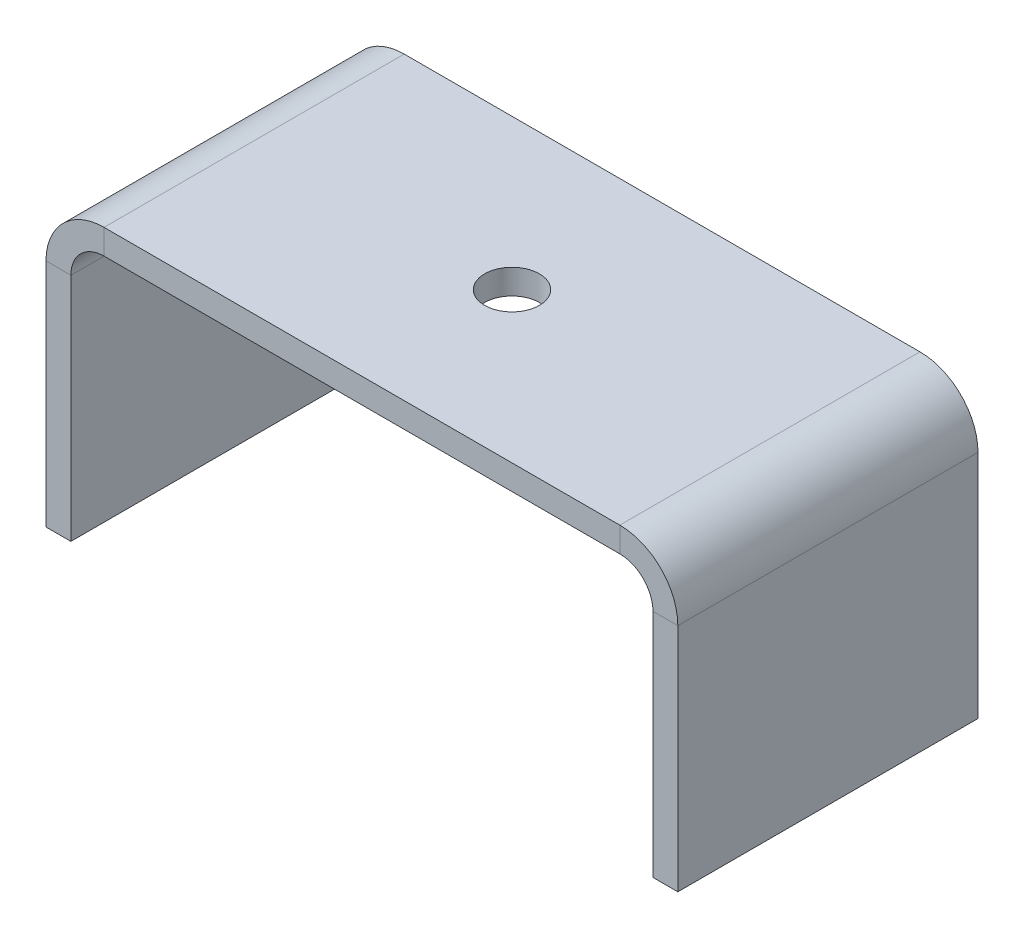
ISO-10303-21;
HEADER;
FILE_DESCRIPTION(('STEP AP214'),'2;1');
FILE_NAME('part.step','',(''),(''),'','','');
FILE_SCHEMA(('AUTOMOTIVE_DESIGN { 1 0 10303 214 1 1 1 1 }'));
ENDSEC;
DATA;
#1=APPLICATION_CONTEXT('core data for automotive mechanical design processes');
#2=APPLICATION_PROTOCOL_DEFINITION('international standard','automotive_design',2000,#1);
#3=PRODUCT_CONTEXT('',#1,'mechanical');
#4=PRODUCT('Part','Part','',(#3));
#5=PRODUCT_RELATED_PRODUCT_CATEGORY('part','',(#4));
#6=PRODUCT_DEFINITION_FORMATION('','',#4);
#7=PRODUCT_DEFINITION_CONTEXT('part definition',#1,'design');
#8=PRODUCT_DEFINITION('design','',#6,#7);
#9=PRODUCT_DEFINITION_SHAPE('','',#8);
#10=(LENGTH_UNIT() NAMED_UNIT(*) SI_UNIT(.MILLI.,.METRE.));
#11=(NAMED_UNIT(*) PLANE_ANGLE_UNIT() SI_UNIT($,.RADIAN.));
#12=(NAMED_UNIT(*) SI_UNIT($,.STERADIAN.) SOLID_ANGLE_UNIT());
#13=UNCERTAINTY_MEASURE_WITH_UNIT(LENGTH_MEASURE(1.E-05),#10,'distance_accuracy_value','');
#14=(GEOMETRIC_REPRESENTATION_CONTEXT(3) GLOBAL_UNCERTAINTY_ASSIGNED_CONTEXT((#13)) GLOBAL_UNIT_ASSIGNED_CONTEXT((#10,
#11,#12)) REPRESENTATION_CONTEXT('',''));
#15=CARTESIAN_POINT('',(0.,0.,0.));
#16=DIRECTION('',(0.,0.,1.));
#17=DIRECTION('',(1.,0.,0.));
#18=AXIS2_PLACEMENT_3D('',#15,#16,#17);
#19=CARTESIAN_POINT('',(38.1,10.4,18.1));
#20=DIRECTION('',(0.,0.,1.));
#21=DIRECTION('',(1.,0.,0.));
#22=AXIS2_PLACEMENT_3D('',#19,#20,#21);
#23=PLANE('',#22);
#24=DIRECTION('',(-1.,0.,0.));
#25=VECTOR('',#24,1.);
#26=CARTESIAN_POINT('',(38.1,10.4,18.1));
#27=LINE('',#26,#25);
#28=CARTESIAN_POINT('',(38.1,10.4,18.1));
#29=VERTEX_POINT('',#28);
#30=CARTESIAN_POINT('',(35.1,10.4,18.1));
#31=VERTEX_POINT('',#30);
#32=EDGE_CURVE('E11',#29,#31,#27,.T.);
#33=ORIENTED_EDGE('',*,*,#32,.F.);
#34=CARTESIAN_POINT('',(31.1,10.4,18.1));
#35=DIRECTION('',(0.,0.,-1.));
#36=DIRECTION('',(-1.,0.,0.));
#37=AXIS2_PLACEMENT_3D('',#34,#35,#36);
#38=CIRCLE('',#37,7.);
#39=CARTESIAN_POINT('',(31.0999999999999,17.4,18.1));
#40=VERTEX_POINT('',#39);
#41=EDGE_CURVE('E149',#29,#40,#38,.F.);
#42=ORIENTED_EDGE('',*,*,#41,.T.);
#43=DIRECTION('',(0.,1.,0.));
#44=VECTOR('',#43,1.);
#45=CARTESIAN_POINT('',(31.0999999999999,14.4,18.1));
#46=LINE('',#45,#44);
#47=CARTESIAN_POINT('',(31.0999999999999,14.4,18.1));
#48=VERTEX_POINT('',#47);
#49=EDGE_CURVE('E47',#48,#40,#46,.T.);
#50=ORIENTED_EDGE('',*,*,#49,.F.);
#51=CARTESIAN_POINT('',(31.1,10.4,18.1));
#52=DIRECTION('',(0.,0.,1.));
#53=DIRECTION('',(1.,0.,0.));
#54=AXIS2_PLACEMENT_3D('',#51,#52,#53);
#55=CIRCLE('',#54,4.);
#56=EDGE_CURVE('E244',#31,#48,#55,.T.);
#57=ORIENTED_EDGE('',*,*,#56,.F.);
#58=EDGE_LOOP('',(#33,#42,#50,#57));
#59=FACE_BOUND('',#58,.T.);
#60=ADVANCED_FACE('F39',(#59),#23,.T.);
#61=CARTESIAN_POINT('',(31.0999999999999,14.4,18.1));
#62=DIRECTION('',(0.,0.,1.));
#63=DIRECTION('',(1.,0.,0.));
#64=AXIS2_PLACEMENT_3D('',#61,#62,#63);
#65=PLANE('',#64);
#66=DIRECTION('',(0.,1.,0.));
#67=VECTOR('',#66,1.);
#68=CARTESIAN_POINT('',(38.1,17.4,18.1));
#69=LINE('',#68,#67);
#70=CARTESIAN_POINT('',(38.1,-17.4,18.1));
#71=VERTEX_POINT('',#70);
#72=EDGE_CURVE('E154',#71,#29,#69,.T.);
#73=ORIENTED_EDGE('',*,*,#72,.T.);
#74=ORIENTED_EDGE('',*,*,#32,.T.);
#75=DIRECTION('',(0.,1.,0.));
#76=VECTOR('',#75,1.);
#77=CARTESIAN_POINT('',(35.1,17.4,18.1));
#78=LINE('',#77,#76);
#79=CARTESIAN_POINT('',(35.1,-17.4,18.1));
#80=VERTEX_POINT('',#79);
#81=EDGE_CURVE('E257',#80,#31,#78,.T.);
#82=ORIENTED_EDGE('',*,*,#81,.F.);
#83=DIRECTION('',(-1.,0.,0.));
#84=VECTOR('',#83,1.);
#85=CARTESIAN_POINT('',(38.1,-17.4,18.1));
#86=LINE('',#85,#84);
#87=EDGE_CURVE('E259',#71,#80,#86,.T.);
#88=ORIENTED_EDGE('',*,*,#87,.F.);
#89=EDGE_LOOP('',(#73,#74,#82,#88));
#90=FACE_BOUND('',#89,.T.);
#91=ADVANCED_FACE('F270',(#90),#65,.T.);
#92=CARTESIAN_POINT('',(31.0999999999999,17.4,-18.1));
#93=DIRECTION('',(0.,0.,-1.));
#94=DIRECTION('',(-1.,0.,0.));
#95=AXIS2_PLACEMENT_3D('',#92,#93,#94);
#96=PLANE('',#95);
#97=DIRECTION('',(0.,-1.,0.));
#98=VECTOR('',#97,1.);
#99=CARTESIAN_POINT('',(31.0999999999999,17.4,-18.1));
#100=LINE('',#99,#98);
#101=CARTESIAN_POINT('',(31.0999999999999,17.4,-18.1));
#102=VERTEX_POINT('',#101);
#103=CARTESIAN_POINT('',(31.0999999999999,14.4,-18.1));
#104=VERTEX_POINT('',#103);
#105=EDGE_CURVE('E147',#102,#104,#100,.T.);
#106=ORIENTED_EDGE('',*,*,#105,.F.);
#107=CARTESIAN_POINT('',(31.1,10.4,-18.1));
#108=DIRECTION('',(0.,0.,-1.));
#109=DIRECTION('',(-1.,0.,0.));
#110=AXIS2_PLACEMENT_3D('',#107,#108,#109);
#111=CIRCLE('',#110,7.);
#112=CARTESIAN_POINT('',(38.1,10.4,-18.1));
#113=VERTEX_POINT('',#112);
#114=EDGE_CURVE('E161',#113,#102,#111,.F.);
#115=ORIENTED_EDGE('',*,*,#114,.F.);
#116=DIRECTION('',(1.,0.,0.));
#117=VECTOR('',#116,1.);
#118=CARTESIAN_POINT('',(35.1,10.4,-18.1));
#119=LINE('',#118,#117);
#120=CARTESIAN_POINT('',(35.1,10.4,-18.1));
#121=VERTEX_POINT('',#120);
#122=EDGE_CURVE('E235',#121,#113,#119,.T.);
#123=ORIENTED_EDGE('',*,*,#122,.F.);
#124=CARTESIAN_POINT('',(31.1,10.4,-18.1));
#125=DIRECTION('',(0.,0.,1.));
#126=DIRECTION('',(1.,0.,0.));
#127=AXIS2_PLACEMENT_3D('',#124,#125,#126);
#128=CIRCLE('',#127,4.);
#129=EDGE_CURVE('E189',#121,#104,#128,.T.);
#130=ORIENTED_EDGE('',*,*,#129,.T.);
#131=EDGE_LOOP('',(#106,#115,#123,#130));
#132=FACE_BOUND('',#131,.T.);
#133=ADVANCED_FACE('F249',(#132),#96,.T.);
#134=CARTESIAN_POINT('',(35.1,10.4,-18.1));
#135=DIRECTION('',(0.,0.,-1.));
#136=DIRECTION('',(-1.,0.,0.));
#137=AXIS2_PLACEMENT_3D('',#134,#135,#136);
#138=PLANE('',#137);
#139=DIRECTION('',(-1.,0.,0.));
#140=VECTOR('',#139,1.);
#141=CARTESIAN_POINT('',(-38.1,17.4,-18.1));
#142=LINE('',#141,#140);
#143=CARTESIAN_POINT('',(-31.1,17.4,-18.1));
#144=VERTEX_POINT('',#143);
#145=EDGE_CURVE('E202',#102,#144,#142,.T.);
#146=ORIENTED_EDGE('',*,*,#145,.F.);
#147=ORIENTED_EDGE('',*,*,#105,.T.);
#148=DIRECTION('',(1.,0.,0.));
#149=VECTOR('',#148,1.);
#150=CARTESIAN_POINT('',(-38.1,14.4,-18.1));
#151=LINE('',#150,#149);
#152=CARTESIAN_POINT('',(-31.1,14.4,-18.1));
#153=VERTEX_POINT('',#152);
#154=EDGE_CURVE('E187',#104,#153,#151,.F.);
#155=ORIENTED_EDGE('',*,*,#154,.T.);
#156=DIRECTION('',(0.,1.,0.));
#157=VECTOR('',#156,1.);
#158=CARTESIAN_POINT('',(-31.1,14.4,-18.1));
#159=LINE('',#158,#157);
#160=EDGE_CURVE('E96',#153,#144,#159,.T.);
#161=ORIENTED_EDGE('',*,*,#160,.T.);
#162=EDGE_LOOP('',(#146,#147,#155,#161));
#163=FACE_BOUND('',#162,.T.);
#164=ADVANCED_FACE('F237',(#163),#138,.T.);
#165=CARTESIAN_POINT('',(-31.1,17.4,18.1));
#166=DIRECTION('',(0.,0.,1.));
#167=DIRECTION('',(1.,0.,0.));
#168=AXIS2_PLACEMENT_3D('',#165,#166,#167);
#169=PLANE('',#168);
#170=DIRECTION('',(0.,-1.,0.));
#171=VECTOR('',#170,1.);
#172=CARTESIAN_POINT('',(-31.1,17.4,18.1));
#173=LINE('',#172,#171);
#174=CARTESIAN_POINT('',(-31.1,17.4,18.1));
#175=VERTEX_POINT('',#174);
#176=CARTESIAN_POINT('',(-31.1,14.4,18.1));
#177=VERTEX_POINT('',#176);
#178=EDGE_CURVE('E233',#175,#177,#173,.T.);
#179=ORIENTED_EDGE('',*,*,#178,.F.);
#180=CARTESIAN_POINT('',(-31.1,10.4,18.1));
#181=DIRECTION('',(0.,0.,-1.));
#182=DIRECTION('',(-1.,0.,0.));
#183=AXIS2_PLACEMENT_3D('',#180,#181,#182);
#184=CIRCLE('',#183,7.);
#185=CARTESIAN_POINT('',(-38.1,10.4,18.1));
#186=VERTEX_POINT('',#185);
#187=EDGE_CURVE('E169',#175,#186,#184,.F.);
#188=ORIENTED_EDGE('',*,*,#187,.T.);
#189=DIRECTION('',(-1.,0.,0.));
#190=VECTOR('',#189,1.);
#191=CARTESIAN_POINT('',(-35.1,10.4,18.1));
#192=LINE('',#191,#190);
#193=CARTESIAN_POINT('',(-35.1,10.4,18.1));
#194=VERTEX_POINT('',#193);
#195=EDGE_CURVE('E55',#194,#186,#192,.T.);
#196=ORIENTED_EDGE('',*,*,#195,.F.);
#197=CARTESIAN_POINT('',(-31.1,10.4,18.1));
#198=DIRECTION('',(0.,0.,1.));
#199=DIRECTION('',(1.,0.,0.));
#200=AXIS2_PLACEMENT_3D('',#197,#198,#199);
#201=CIRCLE('',#200,4.);
#202=EDGE_CURVE('E261',#177,#194,#201,.T.);
#203=ORIENTED_EDGE('',*,*,#202,.F.);
#204=EDGE_LOOP('',(#179,#188,#196,#203));
#205=FACE_BOUND('',#204,.T.);
#206=ADVANCED_FACE('F296',(#205),#169,.T.);
#207=CARTESIAN_POINT('',(-35.1,10.4,18.1));
#208=DIRECTION('',(0.,0.,1.));
#209=DIRECTION('',(1.,0.,0.));
#210=AXIS2_PLACEMENT_3D('',#207,#208,#209);
#211=PLANE('',#210);
#212=DIRECTION('',(-1.,0.,0.));
#213=VECTOR('',#212,1.);
#214=CARTESIAN_POINT('',(-38.1,17.4,18.1));
#215=LINE('',#214,#213);
#216=EDGE_CURVE('E139',#40,#175,#215,.T.);
#217=ORIENTED_EDGE('',*,*,#216,.T.);
#218=ORIENTED_EDGE('',*,*,#178,.T.);
#219=DIRECTION('',(1.,0.,0.));
#220=VECTOR('',#219,1.);
#221=CARTESIAN_POINT('',(-38.1,14.4,18.1));
#222=LINE('',#221,#220);
#223=EDGE_CURVE('E142',#48,#177,#222,.F.);
#224=ORIENTED_EDGE('',*,*,#223,.F.);
#225=ORIENTED_EDGE('',*,*,#49,.T.);
#226=EDGE_LOOP('',(#217,#218,#224,#225));
#227=FACE_BOUND('',#226,.T.);
#228=ADVANCED_FACE('F137',(#227),#211,.T.);
#229=CARTESIAN_POINT('',(-38.1,10.4,-18.1));
#230=DIRECTION('',(0.,0.,-1.));
#231=DIRECTION('',(-1.,0.,0.));
#232=AXIS2_PLACEMENT_3D('',#229,#230,#231);
#233=PLANE('',#232);
#234=DIRECTION('',(1.,0.,0.));
#235=VECTOR('',#234,1.);
#236=CARTESIAN_POINT('',(-38.1,10.4,-18.1));
#237=LINE('',#236,#235);
#238=CARTESIAN_POINT('',(-38.1,10.4,-18.1));
#239=VERTEX_POINT('',#238);
#240=CARTESIAN_POINT('',(-35.1,10.4,-18.1));
#241=VERTEX_POINT('',#240);
#242=EDGE_CURVE('E103',#239,#241,#237,.T.);
#243=ORIENTED_EDGE('',*,*,#242,.F.);
#244=CARTESIAN_POINT('',(-31.1,10.4,-18.1));
#245=DIRECTION('',(0.,0.,-1.));
#246=DIRECTION('',(-1.,0.,0.));
#247=AXIS2_PLACEMENT_3D('',#244,#245,#246);
#248=CIRCLE('',#247,7.);
#249=EDGE_CURVE('E204',#144,#239,#248,.F.);
#250=ORIENTED_EDGE('',*,*,#249,.F.);
#251=ORIENTED_EDGE('',*,*,#160,.F.);
#252=CARTESIAN_POINT('',(-31.1,10.4,-18.1));
#253=DIRECTION('',(0.,0.,1.));
#254=DIRECTION('',(1.,0.,0.));
#255=AXIS2_PLACEMENT_3D('',#252,#253,#254);
#256=CIRCLE('',#255,4.);
#257=EDGE_CURVE('E185',#153,#241,#256,.T.);
#258=ORIENTED_EDGE('',*,*,#257,.T.);
#259=EDGE_LOOP('',(#243,#250,#251,#258));
#260=FACE_BOUND('',#259,.T.);
#261=ADVANCED_FACE('F302',(#260),#233,.T.);
#262=CARTESIAN_POINT('',(-31.1,14.4,-18.1));
#263=DIRECTION('',(0.,0.,-1.));
#264=DIRECTION('',(-1.,0.,0.));
#265=AXIS2_PLACEMENT_3D('',#262,#263,#264);
#266=PLANE('',#265);
#267=DIRECTION('',(0.,-1.,0.));
#268=VECTOR('',#267,1.);
#269=CARTESIAN_POINT('',(-38.1,17.4,-18.1));
#270=LINE('',#269,#268);
#271=CARTESIAN_POINT('',(-38.1,-17.4,-18.1));
#272=VERTEX_POINT('',#271);
#273=EDGE_CURVE('E175',#239,#272,#270,.T.);
#274=ORIENTED_EDGE('',*,*,#273,.F.);
#275=ORIENTED_EDGE('',*,*,#242,.T.);
#276=DIRECTION('',(0.,-1.,0.));
#277=VECTOR('',#276,1.);
#278=CARTESIAN_POINT('',(-35.1,17.4,-18.1));
#279=LINE('',#278,#277);
#280=CARTESIAN_POINT('',(-35.1,-17.4,-18.1));
#281=VERTEX_POINT('',#280);
#282=EDGE_CURVE('E182',#241,#281,#279,.T.);
#283=ORIENTED_EDGE('',*,*,#282,.T.);
#284=DIRECTION('',(-1.,0.,0.));
#285=VECTOR('',#284,1.);
#286=CARTESIAN_POINT('',(-35.1,-17.4,-18.1));
#287=LINE('',#286,#285);
#288=EDGE_CURVE('E178',#281,#272,#287,.T.);
#289=ORIENTED_EDGE('',*,*,#288,.T.);
#290=EDGE_LOOP('',(#274,#275,#283,#289));
#291=FACE_BOUND('',#290,.T.);
#292=ADVANCED_FACE('F305',(#291),#266,.T.);
#293=CARTESIAN_POINT('',(-38.1,17.4,18.1));
#294=DIRECTION('',(1.,0.,0.));
#295=DIRECTION('',(0.,1.,0.));
#296=AXIS2_PLACEMENT_3D('',#293,#294,#295);
#297=PLANE('',#296);
#298=ORIENTED_EDGE('',*,*,#273,.T.);
#299=DIRECTION('',(0.,0.,-1.));
#300=VECTOR('',#299,1.);
#301=CARTESIAN_POINT('',(-38.1,-17.4,18.1));
#302=LINE('',#301,#300);
#303=CARTESIAN_POINT('',(-38.1,-17.4,18.1));
#304=VERTEX_POINT('',#303);
#305=EDGE_CURVE('E228',#304,#272,#302,.T.);
#306=ORIENTED_EDGE('',*,*,#305,.F.);
#307=DIRECTION('',(0.,-1.,0.));
#308=VECTOR('',#307,1.);
#309=CARTESIAN_POINT('',(-38.1,17.4,18.1));
#310=LINE('',#309,#308);
#311=EDGE_CURVE('E109',#186,#304,#310,.T.);
#312=ORIENTED_EDGE('',*,*,#311,.F.);
#313=DIRECTION('',(0.,0.,-1.));
#314=VECTOR('',#313,1.);
#315=CARTESIAN_POINT('',(-38.1,10.4,18.1));
#316=LINE('',#315,#314);
#317=EDGE_CURVE('E171',#186,#239,#316,.T.);
#318=ORIENTED_EDGE('',*,*,#317,.T.);
#319=EDGE_LOOP('',(#298,#306,#312,#318));
#320=FACE_BOUND('',#319,.T.);
#321=ADVANCED_FACE('F308',(#320),#297,.F.);
#322=CARTESIAN_POINT('',(-35.1,-17.4,18.1));
#323=DIRECTION('',(0.,-1.,0.));
#324=DIRECTION('',(0.,0.,-1.));
#325=AXIS2_PLACEMENT_3D('',#322,#323,#324);
#326=PLANE('',#325);
#327=ORIENTED_EDGE('',*,*,#288,.F.);
#328=DIRECTION('',(0.,0.,-1.));
#329=VECTOR('',#328,1.);
#330=CARTESIAN_POINT('',(-35.1,-17.4,18.1));
#331=LINE('',#330,#329);
#332=CARTESIAN_POINT('',(-35.1,-17.4,18.1));
#333=VERTEX_POINT('',#332);
#334=EDGE_CURVE('E226',#333,#281,#331,.T.);
#335=ORIENTED_EDGE('',*,*,#334,.F.);
#336=DIRECTION('',(-1.,0.,0.));
#337=VECTOR('',#336,1.);
#338=CARTESIAN_POINT('',(-35.1,-17.4,18.1));
#339=LINE('',#338,#337);
#340=EDGE_CURVE('E535',#333,#304,#339,.T.);
#341=ORIENTED_EDGE('',*,*,#340,.T.);
#342=ORIENTED_EDGE('',*,*,#305,.T.);
#343=EDGE_LOOP('',(#327,#335,#341,#342));
#344=FACE_BOUND('',#343,.T.);
#345=ADVANCED_FACE('F312',(#344),#326,.T.);
#346=CARTESIAN_POINT('',(-35.1,17.4,18.1));
#347=DIRECTION('',(1.,0.,0.));
#348=DIRECTION('',(0.,1.,0.));
#349=AXIS2_PLACEMENT_3D('',#346,#347,#348);
#350=PLANE('',#349);
#351=ORIENTED_EDGE('',*,*,#282,.F.);
#352=DIRECTION('',(0.,0.,-1.));
#353=VECTOR('',#352,1.);
#354=CARTESIAN_POINT('',(-35.1,10.4,18.1));
#355=LINE('',#354,#353);
#356=EDGE_CURVE('E223',#194,#241,#355,.T.);
#357=ORIENTED_EDGE('',*,*,#356,.F.);
#358=DIRECTION('',(0.,-1.,0.));
#359=VECTOR('',#358,1.);
#360=CARTESIAN_POINT('',(-35.1,17.4,18.1));
#361=LINE('',#360,#359);
#362=EDGE_CURVE('E538',#194,#333,#361,.T.);
#363=ORIENTED_EDGE('',*,*,#362,.T.);
#364=ORIENTED_EDGE('',*,*,#334,.T.);
#365=EDGE_LOOP('',(#351,#357,#363,#364));
#366=FACE_BOUND('',#365,.T.);
#367=ADVANCED_FACE('F316',(#366),#350,.T.);
#368=CARTESIAN_POINT('',(-31.1,10.4,18.1));
#369=DIRECTION('',(0.,0.,-1.));
#370=DIRECTION('',(-1.,0.,0.));
#371=AXIS2_PLACEMENT_3D('',#368,#369,#370);
#372=CYLINDRICAL_SURFACE('',#371,4.);
#373=ORIENTED_EDGE('',*,*,#257,.F.);
#374=DIRECTION('',(0.,0.,-1.));
#375=VECTOR('',#374,1.);
#376=CARTESIAN_POINT('',(-31.1,14.4,18.1));
#377=LINE('',#376,#375);
#378=EDGE_CURVE('E220',#177,#153,#377,.T.);
#379=ORIENTED_EDGE('',*,*,#378,.F.);
#380=ORIENTED_EDGE('',*,*,#202,.T.);
#381=ORIENTED_EDGE('',*,*,#356,.T.);
#382=EDGE_LOOP('',(#373,#379,#380,#381));
#383=FACE_BOUND('',#382,.T.);
#384=ADVANCED_FACE('F320',(#383),#372,.F.);
#385=CARTESIAN_POINT('',(-38.1,14.4,18.1));
#386=DIRECTION('',(0.,-1.,0.));
#387=DIRECTION('',(0.,0.,-1.));
#388=AXIS2_PLACEMENT_3D('',#385,#386,#387);
#389=PLANE('',#388);
#390=CARTESIAN_POINT('',(0.,14.4,0.));
#391=DIRECTION('',(0.,-1.,0.));
#392=DIRECTION('',(0.,0.,-1.));
#393=AXIS2_PLACEMENT_3D('',#390,#391,#392);
#394=CIRCLE('',#393,3.3);
#395=CARTESIAN_POINT('',(0.,14.4,-3.3));
#396=VERTEX_POINT('',#395);
#397=EDGE_CURVE('E528',#396,#396,#394,.F.);
#398=ORIENTED_EDGE('',*,*,#397,.T.);
#399=EDGE_LOOP('',(#398));
#400=FACE_BOUND('',#399,.T.);
#401=ORIENTED_EDGE('',*,*,#154,.F.);
#402=DIRECTION('',(0.,0.,-1.));
#403=VECTOR('',#402,1.);
#404=CARTESIAN_POINT('',(31.0999999999999,14.4,18.1));
#405=LINE('',#404,#403);
#406=EDGE_CURVE('E217',#48,#104,#405,.T.);
#407=ORIENTED_EDGE('',*,*,#406,.F.);
#408=ORIENTED_EDGE('',*,*,#223,.T.);
#409=ORIENTED_EDGE('',*,*,#378,.T.);
#410=EDGE_LOOP('',(#401,#407,#408,#409));
#411=FACE_BOUND('',#410,.T.);
#412=ADVANCED_FACE('F246',(#400,#411),#389,.T.);
#413=CARTESIAN_POINT('',(31.1,10.4,18.1));
#414=DIRECTION('',(0.,0.,-1.));
#415=DIRECTION('',(-1.,0.,0.));
#416=AXIS2_PLACEMENT_3D('',#413,#414,#415);
#417=CYLINDRICAL_SURFACE('',#416,4.);
#418=ORIENTED_EDGE('',*,*,#129,.F.);
#419=DIRECTION('',(0.,0.,-1.));
#420=VECTOR('',#419,1.);
#421=CARTESIAN_POINT('',(35.1,10.4,18.1));
#422=LINE('',#421,#420);
#423=EDGE_CURVE('E214',#31,#121,#422,.T.);
#424=ORIENTED_EDGE('',*,*,#423,.F.);
#425=ORIENTED_EDGE('',*,*,#56,.T.);
#426=ORIENTED_EDGE('',*,*,#406,.T.);
#427=EDGE_LOOP('',(#418,#424,#425,#426));
#428=FACE_BOUND('',#427,.T.);
#429=ADVANCED_FACE('F242',(#428),#417,.F.);
#430=CARTESIAN_POINT('',(35.1,17.4,18.1));
#431=DIRECTION('',(-1.,0.,0.));
#432=DIRECTION('',(0.,-1.,0.));
#433=AXIS2_PLACEMENT_3D('',#430,#431,#432);
#434=PLANE('',#433);
#435=DIRECTION('',(0.,1.,0.));
#436=VECTOR('',#435,1.);
#437=CARTESIAN_POINT('',(35.1,17.4,-18.1));
#438=LINE('',#437,#436);
#439=CARTESIAN_POINT('',(35.1,-17.4,-18.1));
#440=VERTEX_POINT('',#439);
#441=EDGE_CURVE('E192',#440,#121,#438,.T.);
#442=ORIENTED_EDGE('',*,*,#441,.F.);
#443=DIRECTION('',(0.,0.,-1.));
#444=VECTOR('',#443,1.);
#445=CARTESIAN_POINT('',(35.1,-17.4,18.1));
#446=LINE('',#445,#444);
#447=EDGE_CURVE('E212',#80,#440,#446,.T.);
#448=ORIENTED_EDGE('',*,*,#447,.F.);
#449=ORIENTED_EDGE('',*,*,#81,.T.);
#450=ORIENTED_EDGE('',*,*,#423,.T.);
#451=EDGE_LOOP('',(#442,#448,#449,#450));
#452=FACE_BOUND('',#451,.T.);
#453=ADVANCED_FACE('F255',(#452),#434,.T.);
#454=CARTESIAN_POINT('',(38.1,-17.4,18.1));
#455=DIRECTION('',(0.,-1.,0.));
#456=DIRECTION('',(0.,0.,-1.));
#457=AXIS2_PLACEMENT_3D('',#454,#455,#456);
#458=PLANE('',#457);
#459=DIRECTION('',(-1.,0.,0.));
#460=VECTOR('',#459,1.);
#461=CARTESIAN_POINT('',(38.1,-17.4,-18.1));
#462=LINE('',#461,#460);
#463=CARTESIAN_POINT('',(38.1,-17.4,-18.1));
#464=VERTEX_POINT('',#463);
#465=EDGE_CURVE('E195',#464,#440,#462,.T.);
#466=ORIENTED_EDGE('',*,*,#465,.F.);
#467=DIRECTION('',(0.,0.,-1.));
#468=VECTOR('',#467,1.);
#469=CARTESIAN_POINT('',(38.1,-17.4,18.1));
#470=LINE('',#469,#468);
#471=EDGE_CURVE('E210',#71,#464,#470,.T.);
#472=ORIENTED_EDGE('',*,*,#471,.F.);
#473=ORIENTED_EDGE('',*,*,#87,.T.);
#474=ORIENTED_EDGE('',*,*,#447,.T.);
#475=EDGE_LOOP('',(#466,#472,#473,#474));
#476=FACE_BOUND('',#475,.T.);
#477=ADVANCED_FACE('F276',(#476),#458,.T.);
#478=CARTESIAN_POINT('',(38.1,17.4,18.1));
#479=DIRECTION('',(-1.,0.,0.));
#480=DIRECTION('',(0.,-1.,0.));
#481=AXIS2_PLACEMENT_3D('',#478,#479,#480);
#482=PLANE('',#481);
#483=DIRECTION('',(0.,1.,0.));
#484=VECTOR('',#483,1.);
#485=CARTESIAN_POINT('',(38.1,17.4,-18.1));
#486=LINE('',#485,#484);
#487=EDGE_CURVE('E198',#464,#113,#486,.T.);
#488=ORIENTED_EDGE('',*,*,#487,.T.);
#489=DIRECTION('',(0.,0.,-1.));
#490=VECTOR('',#489,1.);
#491=CARTESIAN_POINT('',(38.1,10.4,18.1));
#492=LINE('',#491,#490);
#493=EDGE_CURVE('E163',#29,#113,#492,.T.);
#494=ORIENTED_EDGE('',*,*,#493,.F.);
#495=ORIENTED_EDGE('',*,*,#72,.F.);
#496=ORIENTED_EDGE('',*,*,#471,.T.);
#497=EDGE_LOOP('',(#488,#494,#495,#496));
#498=FACE_BOUND('',#497,.T.);
#499=ADVANCED_FACE('F272',(#498),#482,.F.);
#500=CARTESIAN_POINT('',(31.1,10.4,18.1));
#501=DIRECTION('',(0.,0.,-1.));
#502=DIRECTION('',(-1.,0.,0.));
#503=AXIS2_PLACEMENT_3D('',#500,#501,#502);
#504=CYLINDRICAL_SURFACE('',#503,7.);
#505=ORIENTED_EDGE('',*,*,#114,.T.);
#506=DIRECTION('',(0.,0.,-1.));
#507=VECTOR('',#506,1.);
#508=CARTESIAN_POINT('',(31.0999999999999,17.4,18.1));
#509=LINE('',#508,#507);
#510=EDGE_CURVE('E158',#40,#102,#509,.T.);
#511=ORIENTED_EDGE('',*,*,#510,.F.);
#512=ORIENTED_EDGE('',*,*,#41,.F.);
#513=ORIENTED_EDGE('',*,*,#493,.T.);
#514=EDGE_LOOP('',(#505,#511,#512,#513));
#515=FACE_BOUND('',#514,.T.);
#516=ADVANCED_FACE('F159',(#515),#504,.T.);
#517=CARTESIAN_POINT('',(-38.1,17.4,18.1));
#518=DIRECTION('',(0.,-1.,0.));
#519=DIRECTION('',(0.,0.,-1.));
#520=AXIS2_PLACEMENT_3D('',#517,#518,#519);
#521=PLANE('',#520);
#522=CARTESIAN_POINT('',(0.,17.4,0.));
#523=DIRECTION('',(0.,1.,0.));
#524=DIRECTION('',(0.,0.,1.));
#525=AXIS2_PLACEMENT_3D('',#522,#523,#524);
#526=CIRCLE('',#525,3.3);
#527=CARTESIAN_POINT('',(0.,17.4,3.3));
#528=VERTEX_POINT('',#527);
#529=EDGE_CURVE('E179',#528,#528,#526,.T.);
#530=ORIENTED_EDGE('',*,*,#529,.F.);
#531=EDGE_LOOP('',(#530));
#532=FACE_BOUND('',#531,.T.);
#533=ORIENTED_EDGE('',*,*,#145,.T.);
#534=DIRECTION('',(0.,0.,-1.));
#535=VECTOR('',#534,1.);
#536=CARTESIAN_POINT('',(-31.1,17.4,18.1));
#537=LINE('',#536,#535);
#538=EDGE_CURVE('E164',#175,#144,#537,.T.);
#539=ORIENTED_EDGE('',*,*,#538,.F.);
#540=ORIENTED_EDGE('',*,*,#216,.F.);
#541=ORIENTED_EDGE('',*,*,#510,.T.);
#542=EDGE_LOOP('',(#533,#539,#540,#541));
#543=FACE_BOUND('',#542,.T.);
#544=ADVANCED_FACE('F166',(#532,#543),#521,.F.);
#545=CARTESIAN_POINT('',(-31.1,10.4,18.1));
#546=DIRECTION('',(0.,0.,-1.));
#547=DIRECTION('',(-1.,0.,0.));
#548=AXIS2_PLACEMENT_3D('',#545,#546,#547);
#549=CYLINDRICAL_SURFACE('',#548,7.);
#550=ORIENTED_EDGE('',*,*,#249,.T.);
#551=ORIENTED_EDGE('',*,*,#317,.F.);
#552=ORIENTED_EDGE('',*,*,#187,.F.);
#553=ORIENTED_EDGE('',*,*,#538,.T.);
#554=EDGE_LOOP('',(#550,#551,#552,#553));
#555=FACE_BOUND('',#554,.T.);
#556=ADVANCED_FACE('F367',(#555),#549,.T.);
#557=CARTESIAN_POINT('',(-31.1,10.4,18.1));
#558=DIRECTION('',(0.,0.,1.));
#559=DIRECTION('',(1.,0.,0.));
#560=AXIS2_PLACEMENT_3D('',#557,#558,#559);
#561=PLANE('',#560);
#562=ORIENTED_EDGE('',*,*,#311,.T.);
#563=ORIENTED_EDGE('',*,*,#340,.F.);
#564=ORIENTED_EDGE('',*,*,#362,.F.);
#565=ORIENTED_EDGE('',*,*,#195,.T.);
#566=EDGE_LOOP('',(#562,#563,#564,#565));
#567=FACE_BOUND('',#566,.T.);
#568=ADVANCED_FACE('F372',(#567),#561,.T.);
#569=CARTESIAN_POINT('',(-31.1,10.4,-18.1));
#570=DIRECTION('',(0.,0.,1.));
#571=DIRECTION('',(1.,0.,0.));
#572=AXIS2_PLACEMENT_3D('',#569,#570,#571);
#573=PLANE('',#572);
#574=ORIENTED_EDGE('',*,*,#441,.T.);
#575=ORIENTED_EDGE('',*,*,#122,.T.);
#576=ORIENTED_EDGE('',*,*,#487,.F.);
#577=ORIENTED_EDGE('',*,*,#465,.T.);
#578=EDGE_LOOP('',(#574,#575,#576,#577));
#579=FACE_BOUND('',#578,.T.);
#580=ADVANCED_FACE('F274',(#579),#573,.F.);
#581=CARTESIAN_POINT('',(0.,-17.401,0.));
#582=DIRECTION('',(0.,1.,0.));
#583=DIRECTION('',(0.,0.,1.));
#584=AXIS2_PLACEMENT_3D('',#581,#582,#583);
#585=CYLINDRICAL_SURFACE('',#584,3.3);
#586=ORIENTED_EDGE('',*,*,#397,.F.);
#587=EDGE_LOOP('',(#586));
#588=FACE_BOUND('',#587,.T.);
#589=ORIENTED_EDGE('',*,*,#529,.T.);
#590=EDGE_LOOP('',(#589));
#591=FACE_BOUND('',#590,.T.);
#592=ADVANCED_FACE('F391',(#588,#591),#585,.F.);
#593=CLOSED_SHELL('',(#60,#91,#133,#164,#206,#228,#261,#292,#321,#345,#367,#384,#412,#429,#453,
#477,#499,#516,#544,#556,#568,#580,#592));
#594=MANIFOLD_SOLID_BREP('B2',#593);
#595=ADVANCED_BREP_SHAPE_REPRESENTATION('',(#18,#594),#14);
#596=SHAPE_DEFINITION_REPRESENTATION(#9,#595);
ENDSEC;
END-ISO-10303-21;
